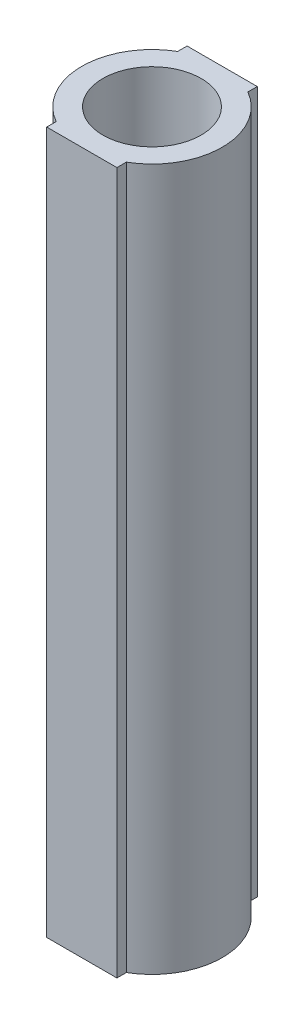
ISO-10303-21;
HEADER;
FILE_DESCRIPTION(('STEP AP214'),'2;1');
FILE_NAME('part.step','',(''),(''),'','','');
FILE_SCHEMA(('AUTOMOTIVE_DESIGN { 1 0 10303 214 1 1 1 1 }'));
ENDSEC;
DATA;
#1=APPLICATION_CONTEXT('core data for automotive mechanical design processes');
#2=APPLICATION_PROTOCOL_DEFINITION('international standard','automotive_design',2000,#1);
#3=PRODUCT_CONTEXT('',#1,'mechanical');
#4=PRODUCT('Part','Part','',(#3));
#5=PRODUCT_RELATED_PRODUCT_CATEGORY('part','',(#4));
#6=PRODUCT_DEFINITION_FORMATION('','',#4);
#7=PRODUCT_DEFINITION_CONTEXT('part definition',#1,'design');
#8=PRODUCT_DEFINITION('design','',#6,#7);
#9=PRODUCT_DEFINITION_SHAPE('','',#8);
#10=(LENGTH_UNIT() NAMED_UNIT(*) SI_UNIT(.MILLI.,.METRE.));
#11=(NAMED_UNIT(*) PLANE_ANGLE_UNIT() SI_UNIT($,.RADIAN.));
#12=(NAMED_UNIT(*) SI_UNIT($,.STERADIAN.) SOLID_ANGLE_UNIT());
#13=UNCERTAINTY_MEASURE_WITH_UNIT(LENGTH_MEASURE(1.E-05),#10,'distance_accuracy_value','');
#14=(GEOMETRIC_REPRESENTATION_CONTEXT(3) GLOBAL_UNCERTAINTY_ASSIGNED_CONTEXT((#13)) GLOBAL_UNIT_ASSIGNED_CONTEXT((#10,
#11,#12)) REPRESENTATION_CONTEXT('',''));
#15=CARTESIAN_POINT('',(0.,0.,0.));
#16=DIRECTION('',(0.,0.,1.));
#17=DIRECTION('',(1.,0.,0.));
#18=AXIS2_PLACEMENT_3D('',#15,#16,#17);
#19=CARTESIAN_POINT('',(0.,100.,0.));
#20=DIRECTION('',(0.,-1.,0.));
#21=DIRECTION('',(0.,0.,-1.));
#22=AXIS2_PLACEMENT_3D('',#19,#20,#21);
#23=CYLINDRICAL_SURFACE('',#22,10.);
#24=DIRECTION('',(0.,1.,0.));
#25=VECTOR('',#24,1.);
#26=CARTESIAN_POINT('',(5.,0.,8.66025403784439));
#27=LINE('',#26,#25);
#28=CARTESIAN_POINT('',(5.,0.,8.66025403784439));
#29=VERTEX_POINT('',#28);
#30=CARTESIAN_POINT('',(5.,100.,8.66025403784439));
#31=VERTEX_POINT('',#30);
#32=EDGE_CURVE('E159',#29,#31,#27,.T.);
#33=ORIENTED_EDGE('',*,*,#32,.F.);
#34=CARTESIAN_POINT('',(0.,0.,0.));
#35=DIRECTION('',(0.,1.,0.));
#36=DIRECTION('',(0.,0.,1.));
#37=AXIS2_PLACEMENT_3D('',#34,#35,#36);
#38=CIRCLE('',#37,10.);
#39=CARTESIAN_POINT('',(5.,0.,-8.66025403784439));
#40=VERTEX_POINT('',#39);
#41=EDGE_CURVE('E203',#29,#40,#38,.T.);
#42=ORIENTED_EDGE('',*,*,#41,.T.);
#43=DIRECTION('',(0.,1.,0.));
#44=VECTOR('',#43,1.);
#45=CARTESIAN_POINT('',(5.,0.,-8.66025403784439));
#46=LINE('',#45,#44);
#47=CARTESIAN_POINT('',(5.,100.,-8.66025403784439));
#48=VERTEX_POINT('',#47);
#49=EDGE_CURVE('E178',#40,#48,#46,.T.);
#50=ORIENTED_EDGE('',*,*,#49,.T.);
#51=CARTESIAN_POINT('',(0.,100.,0.));
#52=DIRECTION('',(0.,1.,0.));
#53=DIRECTION('',(0.,0.,1.));
#54=AXIS2_PLACEMENT_3D('',#51,#52,#53);
#55=CIRCLE('',#54,10.);
#56=EDGE_CURVE('E83',#31,#48,#55,.T.);
#57=ORIENTED_EDGE('',*,*,#56,.F.);
#58=EDGE_LOOP('',(#33,#42,#50,#57));
#59=FACE_BOUND('',#58,.T.);
#60=ADVANCED_FACE('F75',(#59),#23,.T.);
#61=CARTESIAN_POINT('',(-5.,0.,-8.66025403784439));
#62=VERTEX_POINT('',#61);
#63=CARTESIAN_POINT('',(-5.,0.,8.66025403784439));
#64=VERTEX_POINT('',#63);
#65=EDGE_CURVE('E78',#62,#64,#38,.T.);
#66=ORIENTED_EDGE('',*,*,#65,.T.);
#67=DIRECTION('',(0.,1.,0.));
#68=VECTOR('',#67,1.);
#69=CARTESIAN_POINT('',(-5.,0.,8.66025403784439));
#70=LINE('',#69,#68);
#71=CARTESIAN_POINT('',(-5.,100.,8.66025403784439));
#72=VERTEX_POINT('',#71);
#73=EDGE_CURVE('E90',#64,#72,#70,.T.);
#74=ORIENTED_EDGE('',*,*,#73,.T.);
#75=CARTESIAN_POINT('',(-5.,100.,-8.66025403784439));
#76=VERTEX_POINT('',#75);
#77=EDGE_CURVE('E12',#76,#72,#55,.T.);
#78=ORIENTED_EDGE('',*,*,#77,.F.);
#79=DIRECTION('',(0.,1.,0.));
#80=VECTOR('',#79,1.);
#81=CARTESIAN_POINT('',(-5.,0.,-8.66025403784439));
#82=LINE('',#81,#80);
#83=EDGE_CURVE('E195',#62,#76,#82,.T.);
#84=ORIENTED_EDGE('',*,*,#83,.F.);
#85=EDGE_LOOP('',(#66,#74,#78,#84));
#86=FACE_BOUND('',#85,.T.);
#87=ADVANCED_FACE('F225',(#86),#23,.T.);
#88=CARTESIAN_POINT('',(0.,100.,0.));
#89=DIRECTION('',(0.,1.,0.));
#90=DIRECTION('',(0.,0.,1.));
#91=AXIS2_PLACEMENT_3D('',#88,#89,#90);
#92=PLANE('',#91);
#93=ORIENTED_EDGE('',*,*,#77,.T.);
#94=DIRECTION('',(0.,0.,1.));
#95=VECTOR('',#94,1.);
#96=CARTESIAN_POINT('',(-5.,100.,0.));
#97=LINE('',#96,#95);
#98=CARTESIAN_POINT('',(-5.,100.,10.));
#99=VERTEX_POINT('',#98);
#100=EDGE_CURVE('E147',#72,#99,#97,.T.);
#101=ORIENTED_EDGE('',*,*,#100,.T.);
#102=DIRECTION('',(1.,0.,0.));
#103=VECTOR('',#102,1.);
#104=CARTESIAN_POINT('',(0.,100.,10.));
#105=LINE('',#104,#103);
#106=CARTESIAN_POINT('',(5.,100.,10.));
#107=VERTEX_POINT('',#106);
#108=EDGE_CURVE('E139',#99,#107,#105,.T.);
#109=ORIENTED_EDGE('',*,*,#108,.T.);
#110=DIRECTION('',(0.,0.,1.));
#111=VECTOR('',#110,1.);
#112=CARTESIAN_POINT('',(5.,100.,0.));
#113=LINE('',#112,#111);
#114=EDGE_CURVE('E144',#31,#107,#113,.T.);
#115=ORIENTED_EDGE('',*,*,#114,.F.);
#116=ORIENTED_EDGE('',*,*,#56,.T.);
#117=DIRECTION('',(0.,0.,1.));
#118=VECTOR('',#117,1.);
#119=CARTESIAN_POINT('',(5.,100.,0.));
#120=LINE('',#119,#118);
#121=CARTESIAN_POINT('',(5.,100.,-10.));
#122=VERTEX_POINT('',#121);
#123=EDGE_CURVE('E173',#122,#48,#120,.T.);
#124=ORIENTED_EDGE('',*,*,#123,.F.);
#125=DIRECTION('',(1.,0.,0.));
#126=VECTOR('',#125,1.);
#127=CARTESIAN_POINT('',(0.,100.,-10.));
#128=LINE('',#127,#126);
#129=CARTESIAN_POINT('',(-5.,100.,-10.));
#130=VERTEX_POINT('',#129);
#131=EDGE_CURVE('E186',#130,#122,#128,.T.);
#132=ORIENTED_EDGE('',*,*,#131,.F.);
#133=DIRECTION('',(0.,0.,1.));
#134=VECTOR('',#133,1.);
#135=CARTESIAN_POINT('',(-5.,100.,0.));
#136=LINE('',#135,#134);
#137=EDGE_CURVE('E190',#130,#76,#136,.T.);
#138=ORIENTED_EDGE('',*,*,#137,.T.);
#139=EDGE_LOOP('',(#93,#101,#109,#115,#116,#124,#132,#138));
#140=FACE_BOUND('',#139,.T.);
#141=CARTESIAN_POINT('',(0.,100.,0.));
#142=DIRECTION('',(0.,1.,0.));
#143=DIRECTION('',(0.,0.,1.));
#144=AXIS2_PLACEMENT_3D('',#141,#142,#143);
#145=CIRCLE('',#144,7.);
#146=CARTESIAN_POINT('',(0.,100.,7.));
#147=VERTEX_POINT('',#146);
#148=EDGE_CURVE('E200',#147,#147,#145,.T.);
#149=ORIENTED_EDGE('',*,*,#148,.F.);
#150=EDGE_LOOP('',(#149));
#151=FACE_BOUND('',#150,.T.);
#152=ADVANCED_FACE('F141',(#140,#151),#92,.T.);
#153=CARTESIAN_POINT('',(0.,0.,0.));
#154=DIRECTION('',(0.,1.,0.));
#155=DIRECTION('',(0.,0.,1.));
#156=AXIS2_PLACEMENT_3D('',#153,#154,#155);
#157=PLANE('',#156);
#158=ORIENTED_EDGE('',*,*,#65,.F.);
#159=DIRECTION('',(0.,0.,1.));
#160=VECTOR('',#159,1.);
#161=CARTESIAN_POINT('',(-5.,0.,0.));
#162=LINE('',#161,#160);
#163=CARTESIAN_POINT('',(-5.,0.,-10.));
#164=VERTEX_POINT('',#163);
#165=EDGE_CURVE('E189',#164,#62,#162,.T.);
#166=ORIENTED_EDGE('',*,*,#165,.F.);
#167=DIRECTION('',(1.,0.,0.));
#168=VECTOR('',#167,1.);
#169=CARTESIAN_POINT('',(0.,0.,-10.));
#170=LINE('',#169,#168);
#171=CARTESIAN_POINT('',(5.,0.,-10.));
#172=VERTEX_POINT('',#171);
#173=EDGE_CURVE('E187',#164,#172,#170,.T.);
#174=ORIENTED_EDGE('',*,*,#173,.T.);
#175=DIRECTION('',(0.,0.,1.));
#176=VECTOR('',#175,1.);
#177=CARTESIAN_POINT('',(5.,0.,0.));
#178=LINE('',#177,#176);
#179=EDGE_CURVE('E181',#172,#40,#178,.T.);
#180=ORIENTED_EDGE('',*,*,#179,.T.);
#181=ORIENTED_EDGE('',*,*,#41,.F.);
#182=DIRECTION('',(0.,0.,1.));
#183=VECTOR('',#182,1.);
#184=CARTESIAN_POINT('',(5.,0.,0.));
#185=LINE('',#184,#183);
#186=CARTESIAN_POINT('',(5.,0.,10.));
#187=VERTEX_POINT('',#186);
#188=EDGE_CURVE('E158',#29,#187,#185,.T.);
#189=ORIENTED_EDGE('',*,*,#188,.T.);
#190=DIRECTION('',(1.,0.,0.));
#191=VECTOR('',#190,1.);
#192=CARTESIAN_POINT('',(0.,0.,10.));
#193=LINE('',#192,#191);
#194=CARTESIAN_POINT('',(-5.,0.,10.));
#195=VERTEX_POINT('',#194);
#196=EDGE_CURVE('E155',#195,#187,#193,.T.);
#197=ORIENTED_EDGE('',*,*,#196,.F.);
#198=DIRECTION('',(0.,0.,1.));
#199=VECTOR('',#198,1.);
#200=CARTESIAN_POINT('',(-5.,0.,0.));
#201=LINE('',#200,#199);
#202=EDGE_CURVE('E149',#64,#195,#201,.T.);
#203=ORIENTED_EDGE('',*,*,#202,.F.);
#204=EDGE_LOOP('',(#158,#166,#174,#180,#181,#189,#197,#203));
#205=FACE_BOUND('',#204,.T.);
#206=CARTESIAN_POINT('',(0.,0.,0.));
#207=DIRECTION('',(0.,1.,0.));
#208=DIRECTION('',(0.,0.,1.));
#209=AXIS2_PLACEMENT_3D('',#206,#207,#208);
#210=CIRCLE('',#209,7.);
#211=CARTESIAN_POINT('',(0.,0.,7.));
#212=VERTEX_POINT('',#211);
#213=EDGE_CURVE('E198',#212,#212,#210,.T.);
#214=ORIENTED_EDGE('',*,*,#213,.T.);
#215=EDGE_LOOP('',(#214));
#216=FACE_BOUND('',#215,.T.);
#217=ADVANCED_FACE('F207',(#205,#216),#157,.F.);
#218=CARTESIAN_POINT('',(0.,100.,0.));
#219=DIRECTION('',(0.,-1.,0.));
#220=DIRECTION('',(0.,0.,-1.));
#221=AXIS2_PLACEMENT_3D('',#218,#219,#220);
#222=CYLINDRICAL_SURFACE('',#221,7.);
#223=ORIENTED_EDGE('',*,*,#148,.T.);
#224=EDGE_LOOP('',(#223));
#225=FACE_BOUND('',#224,.T.);
#226=ORIENTED_EDGE('',*,*,#213,.F.);
#227=EDGE_LOOP('',(#226));
#228=FACE_BOUND('',#227,.T.);
#229=ADVANCED_FACE('F209',(#225,#228),#222,.F.);
#230=CARTESIAN_POINT('',(0.,0.,-10.));
#231=DIRECTION('',(0.,0.,1.));
#232=DIRECTION('',(1.,0.,0.));
#233=AXIS2_PLACEMENT_3D('',#230,#231,#232);
#234=PLANE('',#233);
#235=ORIENTED_EDGE('',*,*,#131,.T.);
#236=DIRECTION('',(0.,1.,0.));
#237=VECTOR('',#236,1.);
#238=CARTESIAN_POINT('',(5.,0.,-10.));
#239=LINE('',#238,#237);
#240=EDGE_CURVE('E175',#172,#122,#239,.T.);
#241=ORIENTED_EDGE('',*,*,#240,.F.);
#242=ORIENTED_EDGE('',*,*,#173,.F.);
#243=DIRECTION('',(0.,1.,0.));
#244=VECTOR('',#243,1.);
#245=CARTESIAN_POINT('',(-5.,0.,-10.));
#246=LINE('',#245,#244);
#247=EDGE_CURVE('E192',#164,#130,#246,.T.);
#248=ORIENTED_EDGE('',*,*,#247,.T.);
#249=EDGE_LOOP('',(#235,#241,#242,#248));
#250=FACE_BOUND('',#249,.T.);
#251=ADVANCED_FACE('F211',(#250),#234,.F.);
#252=CARTESIAN_POINT('',(-5.,0.,0.));
#253=DIRECTION('',(-1.,0.,0.));
#254=DIRECTION('',(0.,0.,1.));
#255=AXIS2_PLACEMENT_3D('',#252,#253,#254);
#256=PLANE('',#255);
#257=ORIENTED_EDGE('',*,*,#137,.F.);
#258=ORIENTED_EDGE('',*,*,#247,.F.);
#259=ORIENTED_EDGE('',*,*,#165,.T.);
#260=ORIENTED_EDGE('',*,*,#83,.T.);
#261=EDGE_LOOP('',(#257,#258,#259,#260));
#262=FACE_BOUND('',#261,.T.);
#263=ADVANCED_FACE('F218',(#262),#256,.T.);
#264=CARTESIAN_POINT('',(5.,0.,0.));
#265=DIRECTION('',(-1.,0.,0.));
#266=DIRECTION('',(0.,0.,1.));
#267=AXIS2_PLACEMENT_3D('',#264,#265,#266);
#268=PLANE('',#267);
#269=ORIENTED_EDGE('',*,*,#123,.T.);
#270=ORIENTED_EDGE('',*,*,#49,.F.);
#271=ORIENTED_EDGE('',*,*,#179,.F.);
#272=ORIENTED_EDGE('',*,*,#240,.T.);
#273=EDGE_LOOP('',(#269,#270,#271,#272));
#274=FACE_BOUND('',#273,.T.);
#275=ADVANCED_FACE('F236',(#274),#268,.F.);
#276=CARTESIAN_POINT('',(-5.,0.,0.));
#277=DIRECTION('',(-1.,0.,0.));
#278=DIRECTION('',(0.,0.,1.));
#279=AXIS2_PLACEMENT_3D('',#276,#277,#278);
#280=PLANE('',#279);
#281=ORIENTED_EDGE('',*,*,#100,.F.);
#282=ORIENTED_EDGE('',*,*,#73,.F.);
#283=ORIENTED_EDGE('',*,*,#202,.T.);
#284=DIRECTION('',(0.,1.,0.));
#285=VECTOR('',#284,1.);
#286=CARTESIAN_POINT('',(-5.,0.,10.));
#287=LINE('',#286,#285);
#288=EDGE_CURVE('E170',#195,#99,#287,.T.);
#289=ORIENTED_EDGE('',*,*,#288,.T.);
#290=EDGE_LOOP('',(#281,#282,#283,#289));
#291=FACE_BOUND('',#290,.T.);
#292=ADVANCED_FACE('F243',(#291),#280,.T.);
#293=CARTESIAN_POINT('',(0.,0.,10.));
#294=DIRECTION('',(0.,0.,1.));
#295=DIRECTION('',(1.,0.,0.));
#296=AXIS2_PLACEMENT_3D('',#293,#294,#295);
#297=PLANE('',#296);
#298=ORIENTED_EDGE('',*,*,#108,.F.);
#299=ORIENTED_EDGE('',*,*,#288,.F.);
#300=ORIENTED_EDGE('',*,*,#196,.T.);
#301=DIRECTION('',(0.,1.,0.));
#302=VECTOR('',#301,1.);
#303=CARTESIAN_POINT('',(5.,0.,10.));
#304=LINE('',#303,#302);
#305=EDGE_CURVE('E152',#187,#107,#304,.T.);
#306=ORIENTED_EDGE('',*,*,#305,.T.);
#307=EDGE_LOOP('',(#298,#299,#300,#306));
#308=FACE_BOUND('',#307,.T.);
#309=ADVANCED_FACE('F153',(#308),#297,.T.);
#310=CARTESIAN_POINT('',(5.,0.,0.));
#311=DIRECTION('',(-1.,0.,0.));
#312=DIRECTION('',(0.,0.,1.));
#313=AXIS2_PLACEMENT_3D('',#310,#311,#312);
#314=PLANE('',#313);
#315=ORIENTED_EDGE('',*,*,#114,.T.);
#316=ORIENTED_EDGE('',*,*,#305,.F.);
#317=ORIENTED_EDGE('',*,*,#188,.F.);
#318=ORIENTED_EDGE('',*,*,#32,.T.);
#319=EDGE_LOOP('',(#315,#316,#317,#318));
#320=FACE_BOUND('',#319,.T.);
#321=ADVANCED_FACE('F161',(#320),#314,.F.);
#322=CLOSED_SHELL('',(#60,#87,#152,#217,#229,#251,#263,#275,#292,#309,#321));
#323=MANIFOLD_SOLID_BREP('B2',#322);
#324=ADVANCED_BREP_SHAPE_REPRESENTATION('',(#18,#323),#14);
#325=SHAPE_DEFINITION_REPRESENTATION(#9,#324);
ENDSEC;
END-ISO-10303-21;
